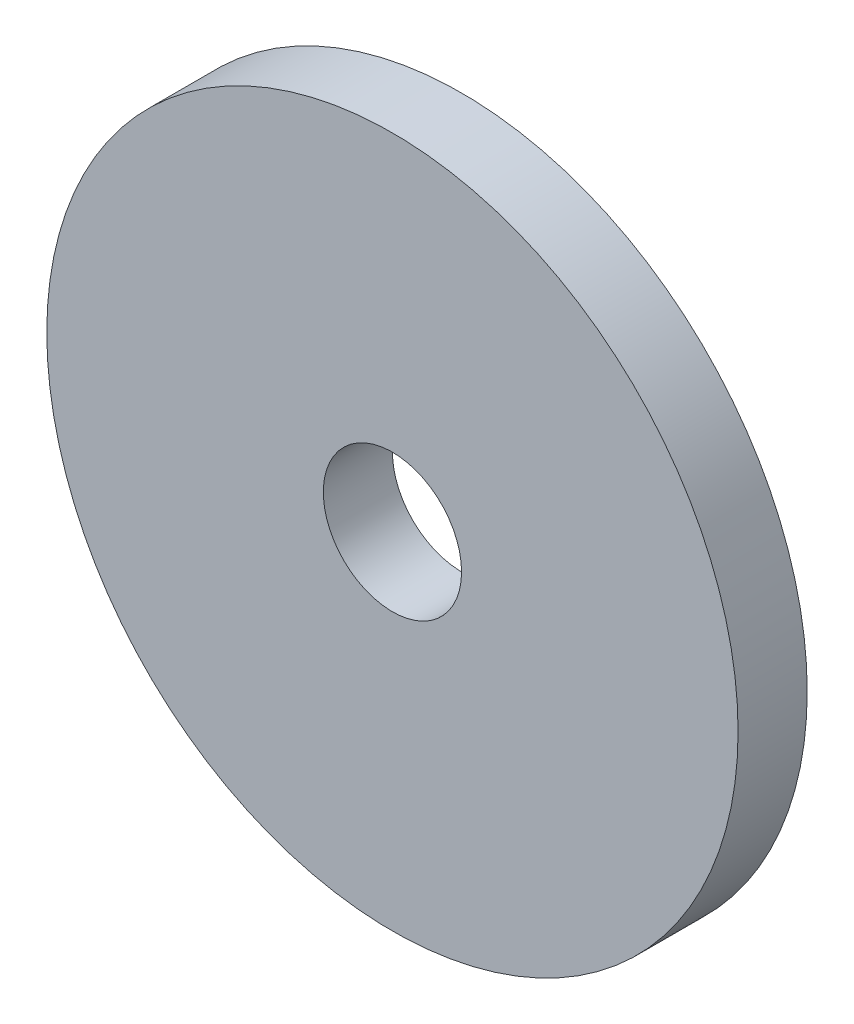
ISO-10303-21;
HEADER;
FILE_DESCRIPTION(('STEP AP214'),'2;1');
FILE_NAME('part.step','',(''),(''),'','','');
FILE_SCHEMA(('AUTOMOTIVE_DESIGN { 1 0 10303 214 1 1 1 1 }'));
ENDSEC;
DATA;
#1=APPLICATION_CONTEXT('core data for automotive mechanical design processes');
#2=APPLICATION_PROTOCOL_DEFINITION('international standard','automotive_design',2000,#1);
#3=PRODUCT_CONTEXT('',#1,'mechanical');
#4=PRODUCT('Part','Part','',(#3));
#5=PRODUCT_RELATED_PRODUCT_CATEGORY('part','',(#4));
#6=PRODUCT_DEFINITION_FORMATION('','',#4);
#7=PRODUCT_DEFINITION_CONTEXT('part definition',#1,'design');
#8=PRODUCT_DEFINITION('design','',#6,#7);
#9=PRODUCT_DEFINITION_SHAPE('','',#8);
#10=(LENGTH_UNIT() NAMED_UNIT(*) SI_UNIT(.MILLI.,.METRE.));
#11=(NAMED_UNIT(*) PLANE_ANGLE_UNIT() SI_UNIT($,.RADIAN.));
#12=(NAMED_UNIT(*) SI_UNIT($,.STERADIAN.) SOLID_ANGLE_UNIT());
#13=UNCERTAINTY_MEASURE_WITH_UNIT(LENGTH_MEASURE(1.E-05),#10,'distance_accuracy_value','');
#14=(GEOMETRIC_REPRESENTATION_CONTEXT(3) GLOBAL_UNCERTAINTY_ASSIGNED_CONTEXT((#13)) GLOBAL_UNIT_ASSIGNED_CONTEXT((#10,
#11,#12)) REPRESENTATION_CONTEXT('',''));
#15=CARTESIAN_POINT('',(0.,0.,0.));
#16=DIRECTION('',(0.,0.,1.));
#17=DIRECTION('',(1.,0.,0.));
#18=AXIS2_PLACEMENT_3D('',#15,#16,#17);
#19=CARTESIAN_POINT('',(-85.,68.,3.));
#20=DIRECTION('',(0.,0.,1.));
#21=DIRECTION('',(1.,0.,0.));
#22=AXIS2_PLACEMENT_3D('',#19,#20,#21);
#23=PLANE('',#22);
#24=CARTESIAN_POINT('',(-85.,68.,3.));
#25=DIRECTION('',(0.,0.,1.));
#26=DIRECTION('',(1.,0.,0.));
#27=AXIS2_PLACEMENT_3D('',#24,#25,#26);
#28=CIRCLE('',#27,15.);
#29=CARTESIAN_POINT('',(-69.9999999999999,68.,3.));
#30=VERTEX_POINT('',#29);
#31=EDGE_CURVE('E10',#30,#30,#28,.T.);
#32=ORIENTED_EDGE('',*,*,#31,.T.);
#33=EDGE_LOOP('',(#32));
#34=FACE_BOUND('',#33,.T.);
#35=CARTESIAN_POINT('',(-85.,68.,3.));
#36=DIRECTION('',(0.,0.,1.));
#37=DIRECTION('',(1.,0.,0.));
#38=AXIS2_PLACEMENT_3D('',#35,#36,#37);
#39=CIRCLE('',#38,2.99999999999998);
#40=CARTESIAN_POINT('',(-82.,68.,3.));
#41=VERTEX_POINT('',#40);
#42=EDGE_CURVE('E42',#41,#41,#39,.T.);
#43=ORIENTED_EDGE('',*,*,#42,.F.);
#44=EDGE_LOOP('',(#43));
#45=FACE_BOUND('',#44,.T.);
#46=ADVANCED_FACE('F31',(#34,#45),#23,.T.);
#47=CARTESIAN_POINT('',(-85.,68.,0.));
#48=DIRECTION('',(0.,0.,1.));
#49=DIRECTION('',(1.,0.,0.));
#50=AXIS2_PLACEMENT_3D('',#47,#48,#49);
#51=PLANE('',#50);
#52=CARTESIAN_POINT('',(-85.,68.,0.));
#53=DIRECTION('',(0.,0.,1.));
#54=DIRECTION('',(1.,0.,0.));
#55=AXIS2_PLACEMENT_3D('',#52,#53,#54);
#56=CIRCLE('',#55,15.);
#57=CARTESIAN_POINT('',(-69.9999999999999,68.,0.));
#58=VERTEX_POINT('',#57);
#59=EDGE_CURVE('E35',#58,#58,#56,.T.);
#60=ORIENTED_EDGE('',*,*,#59,.F.);
#61=EDGE_LOOP('',(#60));
#62=FACE_BOUND('',#61,.T.);
#63=CARTESIAN_POINT('',(-85.,68.,0.));
#64=DIRECTION('',(0.,0.,1.));
#65=DIRECTION('',(1.,0.,0.));
#66=AXIS2_PLACEMENT_3D('',#63,#64,#65);
#67=CIRCLE('',#66,2.99999999999998);
#68=CARTESIAN_POINT('',(-82.,68.,0.));
#69=VERTEX_POINT('',#68);
#70=EDGE_CURVE('E44',#69,#69,#67,.T.);
#71=ORIENTED_EDGE('',*,*,#70,.T.);
#72=EDGE_LOOP('',(#71));
#73=FACE_BOUND('',#72,.T.);
#74=ADVANCED_FACE('F54',(#62,#73),#51,.F.);
#75=CARTESIAN_POINT('',(-85.,68.,3.));
#76=DIRECTION('',(0.,0.,-1.));
#77=DIRECTION('',(-1.,0.,0.));
#78=AXIS2_PLACEMENT_3D('',#75,#76,#77);
#79=CYLINDRICAL_SURFACE('',#78,15.);
#80=ORIENTED_EDGE('',*,*,#31,.F.);
#81=EDGE_LOOP('',(#80));
#82=FACE_BOUND('',#81,.T.);
#83=ORIENTED_EDGE('',*,*,#59,.T.);
#84=EDGE_LOOP('',(#83));
#85=FACE_BOUND('',#84,.T.);
#86=ADVANCED_FACE('F33',(#82,#85),#79,.T.);
#87=CARTESIAN_POINT('',(-85.,68.,3.));
#88=DIRECTION('',(0.,0.,-1.));
#89=DIRECTION('',(-1.,0.,0.));
#90=AXIS2_PLACEMENT_3D('',#87,#88,#89);
#91=CYLINDRICAL_SURFACE('',#90,2.99999999999998);
#92=ORIENTED_EDGE('',*,*,#42,.T.);
#93=EDGE_LOOP('',(#92));
#94=FACE_BOUND('',#93,.T.);
#95=ORIENTED_EDGE('',*,*,#70,.F.);
#96=EDGE_LOOP('',(#95));
#97=FACE_BOUND('',#96,.T.);
#98=ADVANCED_FACE('F50',(#94,#97),#91,.F.);
#99=CLOSED_SHELL('',(#46,#74,#86,#98));
#100=MANIFOLD_SOLID_BREP('B2',#99);
#101=ADVANCED_BREP_SHAPE_REPRESENTATION('',(#18,#100),#14);
#102=SHAPE_DEFINITION_REPRESENTATION(#9,#101);
ENDSEC;
END-ISO-10303-21;
